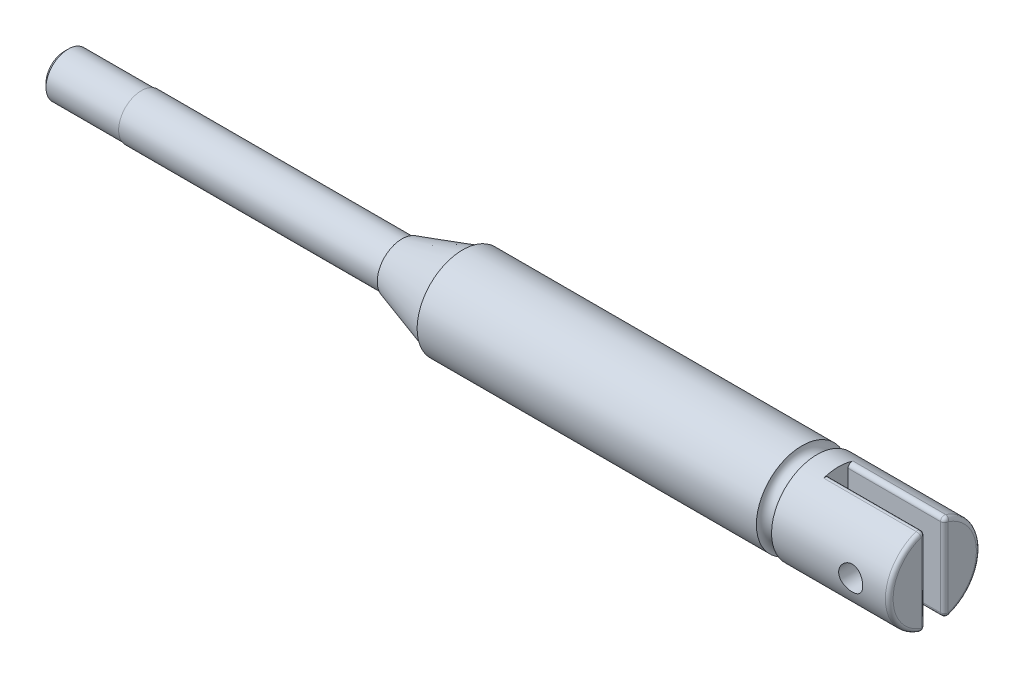
ISO-10303-21;
HEADER;
FILE_DESCRIPTION(('STEP AP214'),'2;1');
FILE_NAME('part.step','',(''),(''),'','','');
FILE_SCHEMA(('AUTOMOTIVE_DESIGN { 1 0 10303 214 1 1 1 1 }'));
ENDSEC;
DATA;
#1=APPLICATION_CONTEXT('core data for automotive mechanical design processes');
#2=APPLICATION_PROTOCOL_DEFINITION('international standard','automotive_design',2000,#1);
#3=PRODUCT_CONTEXT('',#1,'mechanical');
#4=PRODUCT('Part','Part','',(#3));
#5=PRODUCT_RELATED_PRODUCT_CATEGORY('part','',(#4));
#6=PRODUCT_DEFINITION_FORMATION('','',#4);
#7=PRODUCT_DEFINITION_CONTEXT('part definition',#1,'design');
#8=PRODUCT_DEFINITION('design','',#6,#7);
#9=PRODUCT_DEFINITION_SHAPE('','',#8);
#10=(LENGTH_UNIT() NAMED_UNIT(*) SI_UNIT(.MILLI.,.METRE.));
#11=(NAMED_UNIT(*) PLANE_ANGLE_UNIT() SI_UNIT($,.RADIAN.));
#12=(NAMED_UNIT(*) SI_UNIT($,.STERADIAN.) SOLID_ANGLE_UNIT());
#13=UNCERTAINTY_MEASURE_WITH_UNIT(LENGTH_MEASURE(1.E-05),#10,'distance_accuracy_value','');
#14=(GEOMETRIC_REPRESENTATION_CONTEXT(3) GLOBAL_UNCERTAINTY_ASSIGNED_CONTEXT((#13)) GLOBAL_UNIT_ASSIGNED_CONTEXT((#10,
#11,#12)) REPRESENTATION_CONTEXT('',''));
#15=CARTESIAN_POINT('',(0.,0.,0.));
#16=DIRECTION('',(0.,0.,1.));
#17=DIRECTION('',(1.,0.,0.));
#18=AXIS2_PLACEMENT_3D('',#15,#16,#17);
#19=CARTESIAN_POINT('',(-76.0312923411787,0.,0.));
#20=DIRECTION('',(-1.,0.,0.));
#21=DIRECTION('',(0.,-1.,0.));
#22=AXIS2_PLACEMENT_3D('',#19,#20,#21);
#23=CYLINDRICAL_SURFACE('',#22,1.49999999999999);
#24=CARTESIAN_POINT('',(-52.28844,0.,0.));
#25=DIRECTION('',(-1.,0.,0.));
#26=DIRECTION('',(0.,-1.,0.));
#27=AXIS2_PLACEMENT_3D('',#24,#25,#26);
#28=CIRCLE('',#27,1.50000000000001);
#29=CARTESIAN_POINT('',(-52.28844,-1.50000000000001,0.));
#30=VERTEX_POINT('',#29);
#31=EDGE_CURVE('E333',#30,#30,#28,.T.);
#32=ORIENTED_EDGE('',*,*,#31,.F.);
#33=EDGE_LOOP('',(#32));
#34=FACE_BOUND('',#33,.T.);
#35=CARTESIAN_POINT('',(-35.114992,0.,0.));
#36=DIRECTION('',(-1.,0.,0.));
#37=DIRECTION('',(0.,-1.,0.));
#38=AXIS2_PLACEMENT_3D('',#35,#36,#37);
#39=CIRCLE('',#38,1.49999999999999);
#40=CARTESIAN_POINT('',(-35.114992,-1.49999999999998,0.));
#41=VERTEX_POINT('',#40);
#42=EDGE_CURVE('E326',#41,#41,#39,.T.);
#43=ORIENTED_EDGE('',*,*,#42,.T.);
#44=EDGE_LOOP('',(#43));
#45=FACE_BOUND('',#44,.T.);
#46=ADVANCED_FACE('F39',(#34,#45),#23,.T.);
#47=CARTESIAN_POINT('',(-35.114992,1.627,0.));
#48=DIRECTION('',(1.,0.,0.));
#49=DIRECTION('',(0.,1.,0.));
#50=AXIS2_PLACEMENT_3D('',#47,#48,#49);
#51=PLANE('',#50);
#52=ORIENTED_EDGE('',*,*,#42,.F.);
#53=EDGE_LOOP('',(#52));
#54=FACE_BOUND('',#53,.T.);
#55=CARTESIAN_POINT('',(-35.114992,0.,0.));
#56=DIRECTION('',(-1.,0.,0.));
#57=DIRECTION('',(0.,-1.,0.));
#58=AXIS2_PLACEMENT_3D('',#55,#56,#57);
#59=CIRCLE('',#58,1.62699999999999);
#60=CARTESIAN_POINT('',(-35.114992,-1.62699999999998,0.));
#61=VERTEX_POINT('',#60);
#62=EDGE_CURVE('E493',#61,#61,#59,.T.);
#63=ORIENTED_EDGE('',*,*,#62,.T.);
#64=EDGE_LOOP('',(#63));
#65=FACE_BOUND('',#64,.T.);
#66=ADVANCED_FACE('F239',(#54,#65),#51,.F.);
#67=CARTESIAN_POINT('',(-31.115,0.,0.));
#68=DIRECTION('',(1.,0.,0.));
#69=DIRECTION('',(0.,1.,0.));
#70=AXIS2_PLACEMENT_3D('',#67,#68,#69);
#71=CONICAL_SURFACE('',#70,2.87299999999999,0.301974145053179);
#72=ORIENTED_EDGE('',*,*,#62,.F.);
#73=EDGE_LOOP('',(#72));
#74=FACE_BOUND('',#73,.T.);
#75=CARTESIAN_POINT('',(-31.115,0.,0.));
#76=DIRECTION('',(-1.,0.,0.));
#77=DIRECTION('',(0.,-1.,0.));
#78=AXIS2_PLACEMENT_3D('',#75,#76,#77);
#79=CIRCLE('',#78,2.87299999999999);
#80=CARTESIAN_POINT('',(-31.115,-2.87299999999998,0.));
#81=VERTEX_POINT('',#80);
#82=EDGE_CURVE('E490',#81,#81,#79,.T.);
#83=ORIENTED_EDGE('',*,*,#82,.T.);
#84=EDGE_LOOP('',(#83));
#85=FACE_BOUND('',#84,.T.);
#86=ADVANCED_FACE('F247',(#74,#85),#71,.T.);
#87=CARTESIAN_POINT('',(-31.115,3.,0.));
#88=DIRECTION('',(1.,0.,0.));
#89=DIRECTION('',(0.,1.,0.));
#90=AXIS2_PLACEMENT_3D('',#87,#88,#89);
#91=PLANE('',#90);
#92=ORIENTED_EDGE('',*,*,#82,.F.);
#93=EDGE_LOOP('',(#92));
#94=FACE_BOUND('',#93,.T.);
#95=CARTESIAN_POINT('',(-31.115,0.,0.));
#96=DIRECTION('',(-1.,0.,0.));
#97=DIRECTION('',(0.,-1.,0.));
#98=AXIS2_PLACEMENT_3D('',#95,#96,#97);
#99=CIRCLE('',#98,2.99999999999999);
#100=CARTESIAN_POINT('',(-31.115,-2.99999999999998,0.));
#101=VERTEX_POINT('',#100);
#102=EDGE_CURVE('E314',#101,#101,#99,.T.);
#103=ORIENTED_EDGE('',*,*,#102,.T.);
#104=EDGE_LOOP('',(#103));
#105=FACE_BOUND('',#104,.T.);
#106=ADVANCED_FACE('F482',(#94,#105),#91,.F.);
#107=CARTESIAN_POINT('',(-76.0312923411787,0.,0.));
#108=DIRECTION('',(-1.,0.,0.));
#109=DIRECTION('',(0.,-1.,0.));
#110=AXIS2_PLACEMENT_3D('',#107,#108,#109);
#111=CYLINDRICAL_SURFACE('',#110,2.99999999999999);
#112=CARTESIAN_POINT('',(-8.755,0.,0.));
#113=DIRECTION('',(1.,0.,0.));
#114=DIRECTION('',(0.,1.,0.));
#115=AXIS2_PLACEMENT_3D('',#112,#113,#114);
#116=CIRCLE('',#115,2.99999999999999);
#117=CARTESIAN_POINT('',(-8.755,3.,0.));
#118=VERTEX_POINT('',#117);
#119=EDGE_CURVE('E211',#118,#118,#116,.F.);
#120=ORIENTED_EDGE('',*,*,#119,.T.);
#121=EDGE_LOOP('',(#120));
#122=FACE_BOUND('',#121,.T.);
#123=ORIENTED_EDGE('',*,*,#102,.F.);
#124=EDGE_LOOP('',(#123));
#125=FACE_BOUND('',#124,.T.);
#126=ADVANCED_FACE('F342',(#122,#125),#111,.T.);
#127=CARTESIAN_POINT('',(-63.4330682425012,0.,0.));
#128=DIRECTION('',(-1.,0.,0.));
#129=DIRECTION('',(0.,-1.,0.));
#130=AXIS2_PLACEMENT_3D('',#127,#128,#129);
#131=CYLINDRICAL_SURFACE('',#130,1.4605);
#132=CARTESIAN_POINT('',(-57.11444,0.,0.));
#133=DIRECTION('',(1.,0.,0.));
#134=DIRECTION('',(0.,1.,0.));
#135=AXIS2_PLACEMENT_3D('',#132,#133,#134);
#136=CIRCLE('',#135,1.4605);
#137=CARTESIAN_POINT('',(-57.11444,1.4605,0.));
#138=VERTEX_POINT('',#137);
#139=EDGE_CURVE('E150',#138,#138,#136,.T.);
#140=ORIENTED_EDGE('',*,*,#139,.T.);
#141=EDGE_LOOP('',(#140));
#142=FACE_BOUND('',#141,.T.);
#143=CARTESIAN_POINT('',(-52.28844,0.,0.));
#144=DIRECTION('',(-1.,0.,0.));
#145=DIRECTION('',(0.,-1.,0.));
#146=AXIS2_PLACEMENT_3D('',#143,#144,#145);
#147=CIRCLE('',#146,1.4605);
#148=CARTESIAN_POINT('',(-52.28844,-1.4605,0.));
#149=VERTEX_POINT('',#148);
#150=EDGE_CURVE('E198',#149,#149,#147,.T.);
#151=ORIENTED_EDGE('',*,*,#150,.T.);
#152=EDGE_LOOP('',(#151));
#153=FACE_BOUND('',#152,.T.);
#154=ADVANCED_FACE('F337',(#142,#153),#131,.T.);
#155=CARTESIAN_POINT('',(-52.28844,1.50000000000001,0.));
#156=DIRECTION('',(1.,0.,0.));
#157=DIRECTION('',(0.,1.,0.));
#158=AXIS2_PLACEMENT_3D('',#155,#156,#157);
#159=PLANE('',#158);
#160=ORIENTED_EDGE('',*,*,#150,.F.);
#161=EDGE_LOOP('',(#160));
#162=FACE_BOUND('',#161,.T.);
#163=ORIENTED_EDGE('',*,*,#31,.T.);
#164=EDGE_LOOP('',(#163));
#165=FACE_BOUND('',#164,.T.);
#166=ADVANCED_FACE('F255',(#162,#165),#159,.F.);
#167=CARTESIAN_POINT('',(-57.36844,0.,0.));
#168=DIRECTION('',(1.,0.,0.));
#169=DIRECTION('',(0.,1.,0.));
#170=AXIS2_PLACEMENT_3D('',#167,#168,#169);
#171=PLANE('',#170);
#172=CARTESIAN_POINT('',(-57.36844,0.,0.));
#173=DIRECTION('',(1.,0.,0.));
#174=DIRECTION('',(0.,1.,0.));
#175=AXIS2_PLACEMENT_3D('',#172,#173,#174);
#176=CIRCLE('',#175,1.20649999999999);
#177=CARTESIAN_POINT('',(-57.36844,1.20649999999999,0.));
#178=VERTEX_POINT('',#177);
#179=EDGE_CURVE('E321',#178,#178,#176,.F.);
#180=ORIENTED_EDGE('',*,*,#179,.T.);
#181=EDGE_LOOP('',(#180));
#182=FACE_BOUND('',#181,.T.);
#183=ADVANCED_FACE('F234',(#182),#171,.F.);
#184=CARTESIAN_POINT('',(-57.36844,0.,0.));
#185=DIRECTION('',(1.,0.,0.));
#186=DIRECTION('',(0.,1.,0.));
#187=AXIS2_PLACEMENT_3D('',#184,#185,#186);
#188=CONICAL_SURFACE('',#187,1.20649999999999,0.785398163397466);
#189=ORIENTED_EDGE('',*,*,#139,.F.);
#190=EDGE_LOOP('',(#189));
#191=FACE_BOUND('',#190,.T.);
#192=ORIENTED_EDGE('',*,*,#179,.F.);
#193=EDGE_LOOP('',(#192));
#194=FACE_BOUND('',#193,.T.);
#195=ADVANCED_FACE('F224',(#191,#194),#188,.T.);
#196=CARTESIAN_POINT('',(-8.255,0.,0.));
#197=DIRECTION('',(1.,0.,0.));
#198=DIRECTION('',(0.,1.,0.));
#199=AXIS2_PLACEMENT_3D('',#196,#197,#198);
#200=TOROIDAL_SURFACE('',#199,2.99999999999999,0.500000000000001);
#201=ORIENTED_EDGE('',*,*,#119,.F.);
#202=EDGE_LOOP('',(#201));
#203=FACE_BOUND('',#202,.T.);
#204=CARTESIAN_POINT('',(-7.755,0.,0.));
#205=DIRECTION('',(-1.,0.,0.));
#206=DIRECTION('',(0.,-1.,0.));
#207=AXIS2_PLACEMENT_3D('',#204,#205,#206);
#208=CIRCLE('',#207,2.99999999999999);
#209=CARTESIAN_POINT('',(-7.755,-2.99999999999997,0.));
#210=VERTEX_POINT('',#209);
#211=EDGE_CURVE('E43',#210,#210,#208,.F.);
#212=ORIENTED_EDGE('',*,*,#211,.F.);
#213=EDGE_LOOP('',(#212));
#214=FACE_BOUND('',#213,.T.);
#215=ADVANCED_FACE('F221',(#203,#214),#200,.F.);
#216=CARTESIAN_POINT('',(-0.254,0.,0.889));
#217=DIRECTION('',(0.,1.,0.));
#218=DIRECTION('',(-1.,0.,0.));
#219=AXIS2_PLACEMENT_3D('',#216,#217,#218);
#220=CYLINDRICAL_SURFACE('',#219,0.254);
#221=CARTESIAN_POINT('',(-0.253999999999999,-2.59811373884976,0.889));
#222=DIRECTION('',(0.,-1.,0.));
#223=DIRECTION('',(1.,0.,0.));
#224=AXIS2_PLACEMENT_3D('',#221,#222,#223);
#225=CIRCLE('',#224,0.254);
#226=CARTESIAN_POINT('',(0.,-2.59811373884976,0.889));
#227=VERTEX_POINT('',#226);
#228=CARTESIAN_POINT('',(-0.253999999999999,-2.59811373884976,0.635));
#229=VERTEX_POINT('',#228);
#230=EDGE_CURVE('E56',#227,#229,#225,.F.);
#231=ORIENTED_EDGE('',*,*,#230,.T.);
#232=DIRECTION('',(0.,1.,0.));
#233=VECTOR('',#232,1.);
#234=CARTESIAN_POINT('',(-0.253999999999999,-2.99999999999998,0.635));
#235=LINE('',#234,#233);
#236=CARTESIAN_POINT('',(-0.254,2.59811373884978,0.635));
#237=VERTEX_POINT('',#236);
#238=EDGE_CURVE('E181',#237,#229,#235,.F.);
#239=ORIENTED_EDGE('',*,*,#238,.F.);
#240=CARTESIAN_POINT('',(-0.254,2.59811373884978,0.889));
#241=DIRECTION('',(0.,1.,0.));
#242=DIRECTION('',(0.,0.,1.));
#243=AXIS2_PLACEMENT_3D('',#240,#241,#242);
#244=CIRCLE('',#243,0.254);
#245=CARTESIAN_POINT('',(0.,2.59811373884978,0.889));
#246=VERTEX_POINT('',#245);
#247=EDGE_CURVE('E199',#237,#246,#244,.F.);
#248=ORIENTED_EDGE('',*,*,#247,.T.);
#249=DIRECTION('',(0.,1.,0.));
#250=VECTOR('',#249,1.);
#251=CARTESIAN_POINT('',(0.,0.,0.889));
#252=LINE('',#251,#250);
#253=EDGE_CURVE('E177',#227,#246,#252,.T.);
#254=ORIENTED_EDGE('',*,*,#253,.F.);
#255=EDGE_LOOP('',(#231,#239,#248,#254));
#256=FACE_BOUND('',#255,.T.);
#257=ADVANCED_FACE('F223',(#256),#220,.T.);
#258=CARTESIAN_POINT('',(-0.254,0.,-0.889));
#259=DIRECTION('',(0.,-1.,0.));
#260=DIRECTION('',(1.,0.,0.));
#261=AXIS2_PLACEMENT_3D('',#258,#259,#260);
#262=CYLINDRICAL_SURFACE('',#261,0.254);
#263=CARTESIAN_POINT('',(-0.254,2.59811373884978,-0.889));
#264=DIRECTION('',(0.,1.,0.));
#265=DIRECTION('',(-1.,0.,0.));
#266=AXIS2_PLACEMENT_3D('',#263,#264,#265);
#267=CIRCLE('',#266,0.254);
#268=CARTESIAN_POINT('',(0.,2.59811373884978,-0.889));
#269=VERTEX_POINT('',#268);
#270=CARTESIAN_POINT('',(-0.254,2.59811373884978,-0.635));
#271=VERTEX_POINT('',#270);
#272=EDGE_CURVE('E131',#269,#271,#267,.F.);
#273=ORIENTED_EDGE('',*,*,#272,.T.);
#274=DIRECTION('',(0.,-1.,0.));
#275=VECTOR('',#274,1.);
#276=CARTESIAN_POINT('',(-0.253999999999999,-2.99999999999998,-0.635));
#277=LINE('',#276,#275);
#278=CARTESIAN_POINT('',(-0.253999999999999,-2.59811373884976,-0.635));
#279=VERTEX_POINT('',#278);
#280=EDGE_CURVE('E128',#279,#271,#277,.F.);
#281=ORIENTED_EDGE('',*,*,#280,.F.);
#282=CARTESIAN_POINT('',(-0.253999999999999,-2.59811373884976,-0.889));
#283=DIRECTION('',(0.,-1.,0.));
#284=DIRECTION('',(0.,0.,-1.));
#285=AXIS2_PLACEMENT_3D('',#282,#283,#284);
#286=CIRCLE('',#285,0.254);
#287=CARTESIAN_POINT('',(0.,-2.59811373884976,-0.889));
#288=VERTEX_POINT('',#287);
#289=EDGE_CURVE('E122',#279,#288,#286,.F.);
#290=ORIENTED_EDGE('',*,*,#289,.T.);
#291=DIRECTION('',(0.,-1.,0.));
#292=VECTOR('',#291,1.);
#293=CARTESIAN_POINT('',(0.,0.,-0.889));
#294=LINE('',#293,#292);
#295=EDGE_CURVE('E126',#269,#288,#294,.T.);
#296=ORIENTED_EDGE('',*,*,#295,.F.);
#297=EDGE_LOOP('',(#273,#281,#290,#296));
#298=FACE_BOUND('',#297,.T.);
#299=ADVANCED_FACE('F124',(#298),#262,.T.);
#300=CARTESIAN_POINT('',(0.,0.,0.));
#301=DIRECTION('',(-1.,0.,0.));
#302=DIRECTION('',(0.,-1.,0.));
#303=AXIS2_PLACEMENT_3D('',#300,#301,#302);
#304=PLANE('',#303);
#305=CARTESIAN_POINT('',(0.,0.,0.));
#306=DIRECTION('',(-1.,0.,0.));
#307=DIRECTION('',(0.,-1.,0.));
#308=AXIS2_PLACEMENT_3D('',#305,#306,#307);
#309=CIRCLE('',#308,2.74599999999999);
#310=EDGE_CURVE('E145',#288,#269,#309,.F.);
#311=ORIENTED_EDGE('',*,*,#310,.T.);
#312=ORIENTED_EDGE('',*,*,#295,.T.);
#313=EDGE_LOOP('',(#311,#312));
#314=FACE_BOUND('',#313,.T.);
#315=ADVANCED_FACE('F152',(#314),#304,.F.);
#316=CARTESIAN_POINT('',(-0.254,2.59811373884978,-0.889));
#317=DIRECTION('',(0.,0.,1.));
#318=DIRECTION('',(1.,0.,0.));
#319=AXIS2_PLACEMENT_3D('',#316,#317,#318);
#320=SPHERICAL_SURFACE('',#319,0.254);
#321=CARTESIAN_POINT('',(-0.254,2.59811373884978,-0.889));
#322=DIRECTION('',(0.,0.323743627093956,0.946144842989724));
#323=DIRECTION('',(0.,-0.946144842989724,0.323743627093956));
#324=AXIS2_PLACEMENT_3D('',#321,#322,#323);
#325=CIRCLE('',#324,0.254);
#326=CARTESIAN_POINT('',(-0.254000000000005,2.83843452896917,-0.971230881281865));
#327=VERTEX_POINT('',#326);
#328=EDGE_CURVE('E142',#269,#327,#325,.T.);
#329=ORIENTED_EDGE('',*,*,#328,.T.);
#330=CARTESIAN_POINT('',(-0.254000000000005,2.59811373884978,-0.889));
#331=DIRECTION('',(1.,0.,0.));
#332=DIRECTION('',(0.,0.,-1.));
#333=AXIS2_PLACEMENT_3D('',#330,#331,#332);
#334=CIRCLE('',#333,0.254);
#335=EDGE_CURVE('E195',#327,#271,#334,.T.);
#336=ORIENTED_EDGE('',*,*,#335,.T.);
#337=ORIENTED_EDGE('',*,*,#272,.F.);
#338=EDGE_LOOP('',(#329,#336,#337));
#339=FACE_BOUND('',#338,.T.);
#340=ADVANCED_FACE('F264',(#339),#320,.T.);
#341=CARTESIAN_POINT('',(0.,0.,0.));
#342=DIRECTION('',(-1.,0.,0.));
#343=DIRECTION('',(0.,-1.,0.));
#344=AXIS2_PLACEMENT_3D('',#341,#342,#343);
#345=CIRCLE('',#344,2.74599999999999);
#346=EDGE_CURVE('E175',#246,#227,#345,.F.);
#347=ORIENTED_EDGE('',*,*,#346,.T.);
#348=ORIENTED_EDGE('',*,*,#253,.T.);
#349=EDGE_LOOP('',(#347,#348));
#350=FACE_BOUND('',#349,.T.);
#351=ADVANCED_FACE('F267',(#350),#304,.F.);
#352=CARTESIAN_POINT('',(-0.254,2.59811373884978,0.889));
#353=DIRECTION('',(0.,0.,1.));
#354=DIRECTION('',(1.,0.,0.));
#355=AXIS2_PLACEMENT_3D('',#352,#353,#354);
#356=SPHERICAL_SURFACE('',#355,0.254);
#357=CARTESIAN_POINT('',(-0.254,2.59811373884978,0.889));
#358=DIRECTION('',(1.,0.,0.));
#359=DIRECTION('',(0.,1.,0.));
#360=AXIS2_PLACEMENT_3D('',#357,#358,#359);
#361=CIRCLE('',#360,0.254);
#362=CARTESIAN_POINT('',(-0.254000000000005,2.83843452896917,0.971230881281865));
#363=VERTEX_POINT('',#362);
#364=EDGE_CURVE('E202',#237,#363,#361,.T.);
#365=ORIENTED_EDGE('',*,*,#364,.T.);
#366=CARTESIAN_POINT('',(-0.254000000000005,2.59811373884978,0.889));
#367=DIRECTION('',(0.,0.323743627093956,-0.946144842989724));
#368=DIRECTION('',(0.,0.946144842989724,0.323743627093956));
#369=AXIS2_PLACEMENT_3D('',#366,#367,#368);
#370=CIRCLE('',#369,0.254);
#371=EDGE_CURVE('E205',#363,#246,#370,.T.);
#372=ORIENTED_EDGE('',*,*,#371,.T.);
#373=ORIENTED_EDGE('',*,*,#247,.F.);
#374=EDGE_LOOP('',(#365,#372,#373));
#375=FACE_BOUND('',#374,.T.);
#376=ADVANCED_FACE('F282',(#375),#356,.T.);
#377=CARTESIAN_POINT('',(-0.253999999999999,-2.59811373884976,0.889));
#378=DIRECTION('',(0.,0.,1.));
#379=DIRECTION('',(1.,0.,0.));
#380=AXIS2_PLACEMENT_3D('',#377,#378,#379);
#381=SPHERICAL_SURFACE('',#380,0.254);
#382=CARTESIAN_POINT('',(-0.253999999999999,-2.59811373884976,0.889));
#383=DIRECTION('',(0.,-0.323743627093956,-0.946144842989724));
#384=DIRECTION('',(0.,0.946144842989724,-0.323743627093956));
#385=AXIS2_PLACEMENT_3D('',#382,#383,#384);
#386=CIRCLE('',#385,0.254);
#387=CARTESIAN_POINT('',(-0.254000000000004,-2.83843452896915,0.971230881281865));
#388=VERTEX_POINT('',#387);
#389=EDGE_CURVE('E208',#227,#388,#386,.T.);
#390=ORIENTED_EDGE('',*,*,#389,.T.);
#391=CARTESIAN_POINT('',(-0.254000000000004,-2.59811373884976,0.889));
#392=DIRECTION('',(1.,0.,0.));
#393=DIRECTION('',(0.,0.,-1.));
#394=AXIS2_PLACEMENT_3D('',#391,#392,#393);
#395=CIRCLE('',#394,0.254);
#396=EDGE_CURVE('E132',#388,#229,#395,.T.);
#397=ORIENTED_EDGE('',*,*,#396,.T.);
#398=ORIENTED_EDGE('',*,*,#230,.F.);
#399=EDGE_LOOP('',(#390,#397,#398));
#400=FACE_BOUND('',#399,.T.);
#401=ADVANCED_FACE('F285',(#400),#381,.T.);
#402=CARTESIAN_POINT('',(-6.35,-2.99999999999998,0.635));
#403=DIRECTION('',(0.,0.,1.));
#404=DIRECTION('',(1.,0.,0.));
#405=AXIS2_PLACEMENT_3D('',#402,#403,#404);
#406=PLANE('',#405);
#407=CARTESIAN_POINT('',(-2.54,0.,0.635));
#408=DIRECTION('',(0.,0.,1.));
#409=DIRECTION('',(1.,0.,0.));
#410=AXIS2_PLACEMENT_3D('',#407,#408,#409);
#411=CIRCLE('',#410,0.79375);
#412=CARTESIAN_POINT('',(-1.74625,0.,0.635));
#413=VERTEX_POINT('',#412);
#414=EDGE_CURVE('E332',#413,#413,#411,.T.);
#415=ORIENTED_EDGE('',*,*,#414,.T.);
#416=EDGE_LOOP('',(#415));
#417=FACE_BOUND('',#416,.T.);
#418=ORIENTED_EDGE('',*,*,#238,.T.);
#419=DIRECTION('',(-1.,0.,0.));
#420=VECTOR('',#419,1.);
#421=CARTESIAN_POINT('',(-6.35,-2.59811373884976,0.635));
#422=LINE('',#421,#420);
#423=CARTESIAN_POINT('',(-6.35,-2.59811373884976,0.635));
#424=VERTEX_POINT('',#423);
#425=EDGE_CURVE('E183',#229,#424,#422,.T.);
#426=ORIENTED_EDGE('',*,*,#425,.T.);
#427=DIRECTION('',(0.,1.,0.));
#428=VECTOR('',#427,1.);
#429=CARTESIAN_POINT('',(-6.35,-2.99999999999998,0.635));
#430=LINE('',#429,#428);
#431=CARTESIAN_POINT('',(-6.35,2.59811373884978,0.635));
#432=VERTEX_POINT('',#431);
#433=EDGE_CURVE('E310',#424,#432,#430,.T.);
#434=ORIENTED_EDGE('',*,*,#433,.T.);
#435=DIRECTION('',(-1.,0.,0.));
#436=VECTOR('',#435,1.);
#437=CARTESIAN_POINT('',(-6.35,2.59811373884978,0.635));
#438=LINE('',#437,#436);
#439=EDGE_CURVE('E64',#432,#237,#438,.F.);
#440=ORIENTED_EDGE('',*,*,#439,.T.);
#441=EDGE_LOOP('',(#418,#426,#434,#440));
#442=FACE_BOUND('',#441,.T.);
#443=ADVANCED_FACE('F289',(#417,#442),#406,.F.);
#444=CARTESIAN_POINT('',(-6.35,-2.99999999999998,-0.635));
#445=DIRECTION('',(0.,0.,-1.));
#446=DIRECTION('',(-1.,0.,0.));
#447=AXIS2_PLACEMENT_3D('',#444,#445,#446);
#448=PLANE('',#447);
#449=CARTESIAN_POINT('',(-2.54,0.,-0.635));
#450=DIRECTION('',(0.,0.,-1.));
#451=DIRECTION('',(-1.,0.,0.));
#452=AXIS2_PLACEMENT_3D('',#449,#450,#451);
#453=CIRCLE('',#452,0.79375);
#454=CARTESIAN_POINT('',(-3.33375,0.,-0.635));
#455=VERTEX_POINT('',#454);
#456=EDGE_CURVE('E330',#455,#455,#453,.T.);
#457=ORIENTED_EDGE('',*,*,#456,.T.);
#458=EDGE_LOOP('',(#457));
#459=FACE_BOUND('',#458,.T.);
#460=DIRECTION('',(0.,1.,0.));
#461=VECTOR('',#460,1.);
#462=CARTESIAN_POINT('',(-6.35,-2.99999999999998,-0.635));
#463=LINE('',#462,#461);
#464=CARTESIAN_POINT('',(-6.35,-2.59811373884976,-0.635));
#465=VERTEX_POINT('',#464);
#466=CARTESIAN_POINT('',(-6.35,2.59811373884978,-0.635));
#467=VERTEX_POINT('',#466);
#468=EDGE_CURVE('E315',#465,#467,#463,.T.);
#469=ORIENTED_EDGE('',*,*,#468,.F.);
#470=DIRECTION('',(-1.,0.,0.));
#471=VECTOR('',#470,1.);
#472=CARTESIAN_POINT('',(-6.35,-2.59811373884976,-0.635));
#473=LINE('',#472,#471);
#474=EDGE_CURVE('E159',#465,#279,#473,.F.);
#475=ORIENTED_EDGE('',*,*,#474,.T.);
#476=ORIENTED_EDGE('',*,*,#280,.T.);
#477=DIRECTION('',(-1.,0.,0.));
#478=VECTOR('',#477,1.);
#479=CARTESIAN_POINT('',(-6.35,2.59811373884978,-0.635));
#480=LINE('',#479,#478);
#481=EDGE_CURVE('E153',#271,#467,#480,.T.);
#482=ORIENTED_EDGE('',*,*,#481,.T.);
#483=EDGE_LOOP('',(#469,#475,#476,#482));
#484=FACE_BOUND('',#483,.T.);
#485=ADVANCED_FACE('F263',(#459,#484),#448,.F.);
#486=CARTESIAN_POINT('',(-0.253999999999999,-2.59811373884976,-0.889));
#487=DIRECTION('',(0.,0.,1.));
#488=DIRECTION('',(1.,0.,0.));
#489=AXIS2_PLACEMENT_3D('',#486,#487,#488);
#490=SPHERICAL_SURFACE('',#489,0.254);
#491=CARTESIAN_POINT('',(-0.253999999999999,-2.59811373884976,-0.889));
#492=DIRECTION('',(1.,0.,0.));
#493=DIRECTION('',(0.,1.,0.));
#494=AXIS2_PLACEMENT_3D('',#491,#492,#493);
#495=CIRCLE('',#494,0.254);
#496=CARTESIAN_POINT('',(-0.254000000000004,-2.83843452896915,-0.971230881281865));
#497=VERTEX_POINT('',#496);
#498=EDGE_CURVE('E139',#279,#497,#495,.T.);
#499=ORIENTED_EDGE('',*,*,#498,.T.);
#500=CARTESIAN_POINT('',(-0.254000000000004,-2.59811373884976,-0.889));
#501=DIRECTION('',(0.,-0.323743627093957,0.946144842989724));
#502=DIRECTION('',(0.,-0.946144842989724,-0.323743627093957));
#503=AXIS2_PLACEMENT_3D('',#500,#501,#502);
#504=CIRCLE('',#503,0.254);
#505=EDGE_CURVE('E135',#497,#288,#504,.T.);
#506=ORIENTED_EDGE('',*,*,#505,.T.);
#507=ORIENTED_EDGE('',*,*,#289,.F.);
#508=EDGE_LOOP('',(#499,#506,#507));
#509=FACE_BOUND('',#508,.T.);
#510=ADVANCED_FACE('F137',(#509),#490,.T.);
#511=CARTESIAN_POINT('',(-2.54,0.,-2.99999999999999));
#512=DIRECTION('',(0.,0.,1.));
#513=DIRECTION('',(1.,0.,0.));
#514=AXIS2_PLACEMENT_3D('',#511,#512,#513);
#515=CYLINDRICAL_SURFACE('',#514,0.79375);
#516=ORIENTED_EDGE('',*,*,#456,.F.);
#517=EDGE_LOOP('',(#516));
#518=FACE_BOUND('',#517,.T.);
#519=CARTESIAN_POINT('',(-1.74625,0.,-2.99999999999999));
#520=CARTESIAN_POINT('',(-1.74625106466458,0.0437698375668157,-2.9999993282264));
#521=CARTESIAN_POINT('',(-1.74988254999377,0.0875511439939445,-2.99903265897856));
#522=CARTESIAN_POINT('',(-1.76428734018329,0.17385336792853,-2.9952702766813));
#523=CARTESIAN_POINT('',(-1.7750641600128,0.216373654348215,-2.99247366344542));
#524=CARTESIAN_POINT('',(-1.80338534416475,0.298895558183938,-2.98536019494753));
#525=CARTESIAN_POINT('',(-1.82092105910498,0.338900318931544,-2.9810452832695));
#526=CARTESIAN_POINT('',(-1.86223040276898,0.415400954854202,-2.97135167835241));
#527=CARTESIAN_POINT('',(-1.88600442136328,0.45189661052852,-2.96597291863203));
#528=CARTESIAN_POINT('',(-1.93968923528594,0.521177198313556,-2.95459529167835));
#529=CARTESIAN_POINT('',(-1.96971606590674,0.553870498840004,-2.948585955456));
#530=CARTESIAN_POINT('',(-2.03480605532623,0.613821062476154,-2.93669198347927));
#531=CARTESIAN_POINT('',(-2.06986985088904,0.641077637242554,-2.93080736359941));
#532=CARTESIAN_POINT('',(-2.14476729320822,0.689825783926276,-2.91972221312683));
#533=CARTESIAN_POINT('',(-2.1846714436118,0.711212314583401,-2.91453490163149));
#534=CARTESIAN_POINT('',(-2.26766841339288,0.746936853108402,-2.90558545856868));
#535=CARTESIAN_POINT('',(-2.31076065333328,0.761276138213968,-2.90182306877781));
#536=CARTESIAN_POINT('',(-2.39789667894256,0.782181634058109,-2.89625748536585));
#537=CARTESIAN_POINT('',(-2.44189791653429,0.788913803347784,-2.89441253550613));
#538=CARTESIAN_POINT('',(-2.53044095911576,0.794931306686499,-2.89276593751789));
#539=CARTESIAN_POINT('',(-2.57498266329633,0.794218008787497,-2.89296391401602));
#540=CARTESIAN_POINT('',(-2.66204993546567,0.785496664193203,-2.89534340740742));
#541=CARTESIAN_POINT('',(-2.70459730494513,0.777689037954792,-2.89747042426131));
#542=CARTESIAN_POINT('',(-2.78775562385429,0.755321500880883,-2.90338112457289));
#543=CARTESIAN_POINT('',(-2.82836642039022,0.740761057876009,-2.90716493859651));
#544=CARTESIAN_POINT('',(-2.90702314199696,0.705136935568971,-2.91601108429069));
#545=CARTESIAN_POINT('',(-2.94503548852245,0.684002677548692,-2.92108717740622));
#546=CARTESIAN_POINT('',(-3.01704483448691,0.635880102873265,-2.93193848850909));
#547=CARTESIAN_POINT('',(-3.05104105267015,0.608890650096443,-2.93771384208226));
#548=CARTESIAN_POINT('',(-3.11519864441466,0.548797335418491,-2.94954012997449));
#549=CARTESIAN_POINT('',(-3.14520196174313,0.515525063857159,-2.95559396059681));
#550=CARTESIAN_POINT('',(-3.19923505967777,0.444347463545209,-2.96712878584985));
#551=CARTESIAN_POINT('',(-3.22326461205786,0.406441957865631,-2.97260975859004));
#552=CARTESIAN_POINT('',(-3.26473616217239,0.326831593122855,-2.98241416327767));
#553=CARTESIAN_POINT('',(-3.28214993361147,0.285111376395161,-2.98673261299293));
#554=CARTESIAN_POINT('',(-3.30967123600047,0.199195346207609,-2.99368936208497));
#555=CARTESIAN_POINT('',(-3.31978033782868,0.155000067217067,-2.99632802268796));
#556=CARTESIAN_POINT('',(-3.3321580429915,0.0667376523615833,-2.99957341029864));
#557=CARTESIAN_POINT('',(-3.33464158096443,0.0227026605941382,-3.00023582426948));
#558=CARTESIAN_POINT('',(-3.33229070813109,-0.065154514564261,-2.99961399386761));
#559=CARTESIAN_POINT('',(-3.32745704105676,-0.108976719129068,-2.99832994733612));
#560=CARTESIAN_POINT('',(-3.31078538041926,-0.194399831758913,-2.99399540566287));
#561=CARTESIAN_POINT('',(-3.29906693342828,-0.23602574225483,-2.99097507794908));
#562=CARTESIAN_POINT('',(-3.26909688819508,-0.316717136609313,-2.98351028151612));
#563=CARTESIAN_POINT('',(-3.25084458770102,-0.355782344712057,-2.97906565972068));
#564=CARTESIAN_POINT('',(-3.20792399340457,-0.431081141367528,-2.96911443505799));
#565=CARTESIAN_POINT('',(-3.18313832885425,-0.467245269078571,-2.9635889383961));
#566=CARTESIAN_POINT('',(-3.12800244880278,-0.534976580546292,-2.95211485449207));
#567=CARTESIAN_POINT('',(-3.09765115191606,-0.566542868814267,-2.94616618516646));
#568=CARTESIAN_POINT('',(-3.03124314635651,-0.625085613836346,-2.93431188392032));
#569=CARTESIAN_POINT('',(-2.9950515704678,-0.651910529668655,-2.92841201919743));
#570=CARTESIAN_POINT('',(-2.91855627980036,-0.699109160049003,-2.91750500029281));
#571=CARTESIAN_POINT('',(-2.8782527386848,-0.719483146894132,-2.9124978084348));
#572=CARTESIAN_POINT('',(-2.79488111093695,-0.753048198559642,-2.90400040127052));
#573=CARTESIAN_POINT('',(-2.75183079398742,-0.766281053140331,-2.9005013849586));
#574=CARTESIAN_POINT('',(-2.66400796337882,-0.785288661572236,-2.89541367903229));
#575=CARTESIAN_POINT('',(-2.61923588440283,-0.791065285289,-2.89382451047521));
#576=CARTESIAN_POINT('',(-2.53079068680283,-0.794890137295294,-2.89277599719909));
#577=CARTESIAN_POINT('',(-2.48712872977834,-0.793181751627871,-2.893249576234));
#578=CARTESIAN_POINT('',(-2.40073930763013,-0.782648683082195,-2.89611640360626));
#579=CARTESIAN_POINT('',(-2.35801181919211,-0.773824177954277,-2.89850960399424));
#580=CARTESIAN_POINT('',(-2.275005182699,-0.749449449904848,-2.90490641512379));
#581=CARTESIAN_POINT('',(-2.23471010853109,-0.733950041015906,-2.90889784323185));
#582=CARTESIAN_POINT('',(-2.15726201415366,-0.696705015333011,-2.91804184333839));
#583=CARTESIAN_POINT('',(-2.12010948089842,-0.674958432791405,-2.92319459483875));
#584=CARTESIAN_POINT('',(-2.04883749080431,-0.625095478483187,-2.93426733469649));
#585=CARTESIAN_POINT('',(-2.01483725139236,-0.596812658972944,-2.94020524062604));
#586=CARTESIAN_POINT('',(-1.95198634295489,-0.534997634358597,-2.9520783115328));
#587=CARTESIAN_POINT('',(-1.92313692379283,-0.501464158860704,-2.95801347549711));
#588=CARTESIAN_POINT('',(-1.87081279392072,-0.429251570229419,-2.96936104731978));
#589=CARTESIAN_POINT('',(-1.84746340971163,-0.390479337398087,-2.97475989094736));
#590=CARTESIAN_POINT('',(-1.80765096430805,-0.309418659439655,-2.98427885720708));
#591=CARTESIAN_POINT('',(-1.79118341749862,-0.267132526308945,-2.98839981231976));
#592=CARTESIAN_POINT('',(-1.76778827306697,-0.187493841983335,-2.99435591929854));
#593=CARTESIAN_POINT('',(-1.75973001069687,-0.150489373439837,-2.99645714060735));
#594=CARTESIAN_POINT('',(-1.74896066930791,-0.075659407131333,-2.99927940540138));
#595=CARTESIAN_POINT('',(-1.74624907971998,-0.0378339881100275,-3.00000058067095));
#596=CARTESIAN_POINT('',(-1.74625,0.,-2.99999999999999));
#597=B_SPLINE_CURVE_WITH_KNOTS('',3,(#519,#520,#521,#522,#523,#524,#525,#526,#527,#528,#529,
#530,#531,#532,#533,#534,#535,#536,#537,#538,#539,#540,#541,#542,#543,#544,#545,#546,#547,#548,
#549,#550,#551,#552,#553,#554,#555,#556,#557,#558,#559,#560,#561,#562,#563,#564,#565,#566,#567,
#568,#569,#570,#571,#572,#573,#574,#575,#576,#577,#578,#579,#580,#581,#582,#583,#584,#585,#586,
#587,#588,#589,#590,#591,#592,#593,#594,#595,#596),.UNSPECIFIED.,.T.,.F.,(4,2,2,2,2,2,2,2,2,2,2,
2,2,2,2,2,2,2,2,2,2,2,2,2,2,2,2,2,2,2,2,2,2,2,2,2,2,2,4),(0.,0.131170778552684,
0.262406131221829,0.393474096165234,0.524550254315586,0.658319122095874,0.792104915603677,
0.928148246343878,1.06416691158815,1.1971571314056,1.33012291564059,1.45944527739847,
1.58877783239871,1.71954988805291,1.85034734099455,1.98534182002352,2.12034145568787,
2.25591076768455,2.39145091664823,2.52313392623773,2.65480355226297,2.78425176587794,
2.91371389663283,3.04568237466845,3.1776765210025,3.31333069649479,3.44897914518969,
3.58382492836286,3.71863688848134,3.84909835252879,3.97955655793919,4.10903870904436,
4.23854088751621,4.37179895192902,4.50508930803182,4.64117339839338,4.77716864961561,
4.89056152297319,5.00394356759626),.UNSPECIFIED.);
#598=CARTESIAN_POINT('',(-1.74625,0.,-2.99999999999999));
#599=VERTEX_POINT('',#598);
#600=EDGE_CURVE('E361',#599,#599,#597,.T.);
#601=ORIENTED_EDGE('',*,*,#600,.F.);
#602=EDGE_LOOP('',(#601));
#603=FACE_BOUND('',#602,.T.);
#604=ADVANCED_FACE('F262',(#518,#603),#515,.F.);
#605=ORIENTED_EDGE('',*,*,#414,.F.);
#606=EDGE_LOOP('',(#605));
#607=FACE_BOUND('',#606,.T.);
#608=CARTESIAN_POINT('',(-1.74625,0.,2.99999999999999));
#609=CARTESIAN_POINT('',(-1.74625106466458,-0.0437698375668021,2.9999993282264));
#610=CARTESIAN_POINT('',(-1.74988254999377,-0.087551143993931,2.99903265897856));
#611=CARTESIAN_POINT('',(-1.76428734018329,-0.173853367928517,2.9952702766813));
#612=CARTESIAN_POINT('',(-1.77506416001279,-0.216373654348202,2.99247366344542));
#613=CARTESIAN_POINT('',(-1.80338534416474,-0.298895558183926,2.98536019494753));
#614=CARTESIAN_POINT('',(-1.82092105910498,-0.338900318931531,2.98104528326949));
#615=CARTESIAN_POINT('',(-1.86223040276898,-0.415400954854191,2.97135167835241));
#616=CARTESIAN_POINT('',(-1.88600442136327,-0.451896610528509,2.96597291863203));
#617=CARTESIAN_POINT('',(-1.93968923528594,-0.521177198313546,2.95459529167835));
#618=CARTESIAN_POINT('',(-1.96971606590673,-0.553870498839994,2.94858595545599));
#619=CARTESIAN_POINT('',(-2.03480605532622,-0.613821062476145,2.93669198347927));
#620=CARTESIAN_POINT('',(-2.06986985088902,-0.641077637242546,2.93080736359941));
#621=CARTESIAN_POINT('',(-2.1447672932082,-0.689825783926269,2.91972221312683));
#622=CARTESIAN_POINT('',(-2.18467144361178,-0.711212314583395,2.91453490163148));
#623=CARTESIAN_POINT('',(-2.26766841339287,-0.746936853108397,2.90558545856868));
#624=CARTESIAN_POINT('',(-2.31076065333327,-0.761276138213964,2.90182306877781));
#625=CARTESIAN_POINT('',(-2.39789667894254,-0.782181634058106,2.89625748536584));
#626=CARTESIAN_POINT('',(-2.44189791653427,-0.788913803347782,2.89441253550612));
#627=CARTESIAN_POINT('',(-2.53044095911575,-0.794931306686499,2.89276593751788));
#628=CARTESIAN_POINT('',(-2.57498266329631,-0.794218008787498,2.89296391401601));
#629=CARTESIAN_POINT('',(-2.66204993546565,-0.785496664193205,2.89534340740741));
#630=CARTESIAN_POINT('',(-2.70459730494512,-0.777689037954794,2.8974704242613));
#631=CARTESIAN_POINT('',(-2.78775562385428,-0.755321500880887,2.90338112457288));
#632=CARTESIAN_POINT('',(-2.82836642039021,-0.740761057876014,2.90716493859651));
#633=CARTESIAN_POINT('',(-2.90702314199694,-0.705136935568977,2.91601108429068));
#634=CARTESIAN_POINT('',(-2.94503548852244,-0.684002677548699,2.92108717740621));
#635=CARTESIAN_POINT('',(-3.0170448344869,-0.635880102873274,2.93193848850908));
#636=CARTESIAN_POINT('',(-3.05104105267014,-0.608890650096453,2.93771384208226));
#637=CARTESIAN_POINT('',(-3.11519864441465,-0.548797335418502,2.94954012997448));
#638=CARTESIAN_POINT('',(-3.14520196174312,-0.51552506385717,2.9555939605968));
#639=CARTESIAN_POINT('',(-3.19923505967776,-0.444347463545221,2.96712878584984));
#640=CARTESIAN_POINT('',(-3.22326461205786,-0.406441957865644,2.97260975859004));
#641=CARTESIAN_POINT('',(-3.26473616217239,-0.326831593122869,2.98241416327766));
#642=CARTESIAN_POINT('',(-3.28214993361146,-0.285111376395175,2.98673261299293));
#643=CARTESIAN_POINT('',(-3.30967123600047,-0.199195346207623,2.99368936208497));
#644=CARTESIAN_POINT('',(-3.31978033782868,-0.155000067217081,2.99632802268796));
#645=CARTESIAN_POINT('',(-3.3321580429915,-0.0667376523615978,2.99957341029864));
#646=CARTESIAN_POINT('',(-3.33464158096443,-0.0227026605941526,3.00023582426948));
#647=CARTESIAN_POINT('',(-3.33229070813109,0.065154514564247,2.99961399386761));
#648=CARTESIAN_POINT('',(-3.32745704105676,0.108976719129054,2.99832994733612));
#649=CARTESIAN_POINT('',(-3.31078538041926,0.1943998317589,2.99399540566287));
#650=CARTESIAN_POINT('',(-3.29906693342828,0.236025742254817,2.99097507794908));
#651=CARTESIAN_POINT('',(-3.26909688819509,0.316717136609301,2.98351028151612));
#652=CARTESIAN_POINT('',(-3.25084458770103,0.355782344712046,2.97906565972068));
#653=CARTESIAN_POINT('',(-3.20792399340458,0.431081141367517,2.96911443505799));
#654=CARTESIAN_POINT('',(-3.18313832885425,0.467245269078561,2.96358893839611));
#655=CARTESIAN_POINT('',(-3.12800244880279,0.534976580546283,2.95211485449207));
#656=CARTESIAN_POINT('',(-3.09765115191607,0.566542868814258,2.94616618516646));
#657=CARTESIAN_POINT('',(-3.03124314635653,0.625085613836337,2.93431188392033));
#658=CARTESIAN_POINT('',(-2.99505157046782,0.651910529668647,2.92841201919743));
#659=CARTESIAN_POINT('',(-2.91855627980037,0.699109160048995,2.91750500029282));
#660=CARTESIAN_POINT('',(-2.87825273868481,0.719483146894126,2.91249780843481));
#661=CARTESIAN_POINT('',(-2.79488111093697,0.753048198559637,2.90400040127053));
#662=CARTESIAN_POINT('',(-2.75183079398744,0.766281053140328,2.90050138495861));
#663=CARTESIAN_POINT('',(-2.66400796337883,0.785288661572234,2.89541367903229));
#664=CARTESIAN_POINT('',(-2.61923588440284,0.791065285288999,2.89382451047522));
#665=CARTESIAN_POINT('',(-2.53079068680285,0.794890137295294,2.8927759971991));
#666=CARTESIAN_POINT('',(-2.48712872977836,0.793181751627872,2.89324957623401));
#667=CARTESIAN_POINT('',(-2.40073930763014,0.782648683082198,2.89611640360626));
#668=CARTESIAN_POINT('',(-2.35801181919212,0.77382417795428,2.89850960399425));
#669=CARTESIAN_POINT('',(-2.27500518269901,0.749449449904853,2.9049064151238));
#670=CARTESIAN_POINT('',(-2.23471010853111,0.733950041015911,2.90889784323186));
#671=CARTESIAN_POINT('',(-2.15726201415367,0.696705015333018,2.91804184333839));
#672=CARTESIAN_POINT('',(-2.12010948089843,0.674958432791412,2.92319459483876));
#673=CARTESIAN_POINT('',(-2.04883749080432,0.625095478483195,2.9342673346965));
#674=CARTESIAN_POINT('',(-2.01483725139237,0.596812658972953,2.94020524062605));
#675=CARTESIAN_POINT('',(-1.9519863429549,0.534997634358607,2.9520783115328));
#676=CARTESIAN_POINT('',(-1.92313692379283,0.501464158860714,2.95801347549712));
#677=CARTESIAN_POINT('',(-1.87081279392072,0.429251570229429,2.96936104731978));
#678=CARTESIAN_POINT('',(-1.84746340971164,0.390479337398098,2.97475989094737));
#679=CARTESIAN_POINT('',(-1.80765096430806,0.309418659439667,2.98427885720708));
#680=CARTESIAN_POINT('',(-1.79118341749863,0.267132526308957,2.98839981231976));
#681=CARTESIAN_POINT('',(-1.76778827306698,0.187493841983348,2.99435591929854));
#682=CARTESIAN_POINT('',(-1.75973001069687,0.15048937343985,2.99645714060735));
#683=CARTESIAN_POINT('',(-1.74896066930791,0.0756594071313466,2.99927940540138));
#684=CARTESIAN_POINT('',(-1.74624907971998,0.0378339881100412,3.00000058067095));
#685=CARTESIAN_POINT('',(-1.74625,0.,2.99999999999999));
#686=B_SPLINE_CURVE_WITH_KNOTS('',3,(#608,#609,#610,#611,#612,#613,#614,#615,#616,#617,#618,
#619,#620,#621,#622,#623,#624,#625,#626,#627,#628,#629,#630,#631,#632,#633,#634,#635,#636,#637,
#638,#639,#640,#641,#642,#643,#644,#645,#646,#647,#648,#649,#650,#651,#652,#653,#654,#655,#656,
#657,#658,#659,#660,#661,#662,#663,#664,#665,#666,#667,#668,#669,#670,#671,#672,#673,#674,#675,
#676,#677,#678,#679,#680,#681,#682,#683,#684,#685),.UNSPECIFIED.,.T.,.F.,(4,2,2,2,2,2,2,2,2,2,2,
2,2,2,2,2,2,2,2,2,2,2,2,2,2,2,2,2,2,2,2,2,2,2,2,2,2,2,4),(0.,0.131170778552684,
0.262406131221829,0.393474096165234,0.524550254315586,0.658319122095874,0.792104915603678,
0.928148246343878,1.06416691158815,1.1971571314056,1.3301229156406,1.45944527739847,
1.58877783239871,1.71954988805291,1.85034734099455,1.98534182002352,2.12034145568787,
2.25591076768455,2.39145091664823,2.52313392623773,2.65480355226297,2.78425176587794,
2.91371389663283,3.04568237466845,3.1776765210025,3.31333069649478,3.44897914518969,
3.58382492836286,3.71863688848134,3.84909835252879,3.9795565579392,4.10903870904436,
4.23854088751621,4.37179895192902,4.50508930803182,4.64117339839338,4.77716864961561,
4.89056152297319,5.00394356759626),.UNSPECIFIED.);
#687=CARTESIAN_POINT('',(-1.74625,0.,2.99999999999999));
#688=VERTEX_POINT('',#687);
#689=EDGE_CURVE('E353',#688,#688,#686,.T.);
#690=ORIENTED_EDGE('',*,*,#689,.F.);
#691=EDGE_LOOP('',(#690));
#692=FACE_BOUND('',#691,.T.);
#693=ADVANCED_FACE('F277',(#607,#692),#515,.F.);
#694=CARTESIAN_POINT('',(-0.254000000000004,0.,0.));
#695=DIRECTION('',(-1.,0.,0.));
#696=DIRECTION('',(0.,-1.,0.));
#697=AXIS2_PLACEMENT_3D('',#694,#695,#696);
#698=TOROIDAL_SURFACE('',#697,2.74599999999999,0.254);
#699=ORIENTED_EDGE('',*,*,#505,.F.);
#700=CARTESIAN_POINT('',(-0.254000000000004,0.,0.));
#701=DIRECTION('',(-1.,0.,0.));
#702=DIRECTION('',(0.,-1.,0.));
#703=AXIS2_PLACEMENT_3D('',#700,#701,#702);
#704=CIRCLE('',#703,2.99999999999999);
#705=EDGE_CURVE('E170',#327,#497,#704,.T.);
#706=ORIENTED_EDGE('',*,*,#705,.F.);
#707=ORIENTED_EDGE('',*,*,#328,.F.);
#708=ORIENTED_EDGE('',*,*,#310,.F.);
#709=EDGE_LOOP('',(#699,#706,#707,#708));
#710=FACE_BOUND('',#709,.T.);
#711=ADVANCED_FACE('F146',(#710),#698,.T.);
#712=CARTESIAN_POINT('',(-76.0312923411787,2.59811373884977,-0.889));
#713=DIRECTION('',(-1.,0.,0.));
#714=DIRECTION('',(0.,-1.,0.));
#715=AXIS2_PLACEMENT_3D('',#712,#713,#714);
#716=CYLINDRICAL_SURFACE('',#715,0.254);
#717=CARTESIAN_POINT('',(-6.34999999999999,2.59811373884978,-0.889));
#718=DIRECTION('',(-1.,0.,0.));
#719=DIRECTION('',(0.,0.,1.));
#720=AXIS2_PLACEMENT_3D('',#717,#718,#719);
#721=CIRCLE('',#720,0.254);
#722=CARTESIAN_POINT('',(-6.34999999999999,2.83843452896917,-0.971230881281865));
#723=VERTEX_POINT('',#722);
#724=EDGE_CURVE('E48',#467,#723,#721,.T.);
#725=ORIENTED_EDGE('',*,*,#724,.F.);
#726=ORIENTED_EDGE('',*,*,#481,.F.);
#727=ORIENTED_EDGE('',*,*,#335,.F.);
#728=DIRECTION('',(-1.,0.,0.));
#729=VECTOR('',#728,1.);
#730=CARTESIAN_POINT('',(-76.0312923411787,2.83843452896916,-0.971230881281865));
#731=LINE('',#730,#729);
#732=EDGE_CURVE('E168',#723,#327,#731,.F.);
#733=ORIENTED_EDGE('',*,*,#732,.F.);
#734=EDGE_LOOP('',(#725,#726,#727,#733));
#735=FACE_BOUND('',#734,.T.);
#736=ADVANCED_FACE('F276',(#735),#716,.T.);
#737=CARTESIAN_POINT('',(-76.0312923411787,2.59811373884977,0.889));
#738=DIRECTION('',(-1.,0.,0.));
#739=DIRECTION('',(0.,-1.,0.));
#740=AXIS2_PLACEMENT_3D('',#737,#738,#739);
#741=CYLINDRICAL_SURFACE('',#740,0.254);
#742=CARTESIAN_POINT('',(-6.34999999999999,2.59811373884978,0.889));
#743=DIRECTION('',(-1.,0.,0.));
#744=DIRECTION('',(0.,0.,1.));
#745=AXIS2_PLACEMENT_3D('',#742,#743,#744);
#746=CIRCLE('',#745,0.254);
#747=CARTESIAN_POINT('',(-6.34999999999999,2.83843452896917,0.971230881281865));
#748=VERTEX_POINT('',#747);
#749=EDGE_CURVE('E11',#748,#432,#746,.T.);
#750=ORIENTED_EDGE('',*,*,#749,.F.);
#751=DIRECTION('',(-1.,0.,0.));
#752=VECTOR('',#751,1.);
#753=CARTESIAN_POINT('',(-76.0312923411787,2.83843452896916,0.971230881281865));
#754=LINE('',#753,#752);
#755=EDGE_CURVE('E161',#363,#748,#754,.T.);
#756=ORIENTED_EDGE('',*,*,#755,.F.);
#757=ORIENTED_EDGE('',*,*,#364,.F.);
#758=ORIENTED_EDGE('',*,*,#439,.F.);
#759=EDGE_LOOP('',(#750,#756,#757,#758));
#760=FACE_BOUND('',#759,.T.);
#761=ADVANCED_FACE('F279',(#760),#741,.T.);
#762=CARTESIAN_POINT('',(-0.254000000000004,0.,0.));
#763=DIRECTION('',(-1.,0.,0.));
#764=DIRECTION('',(0.,-1.,0.));
#765=AXIS2_PLACEMENT_3D('',#762,#763,#764);
#766=TOROIDAL_SURFACE('',#765,2.74599999999999,0.254);
#767=ORIENTED_EDGE('',*,*,#371,.F.);
#768=CARTESIAN_POINT('',(-0.254000000000004,0.,0.));
#769=DIRECTION('',(-1.,0.,0.));
#770=DIRECTION('',(0.,-1.,0.));
#771=AXIS2_PLACEMENT_3D('',#768,#769,#770);
#772=CIRCLE('',#771,2.99999999999999);
#773=EDGE_CURVE('E164',#388,#363,#772,.T.);
#774=ORIENTED_EDGE('',*,*,#773,.F.);
#775=ORIENTED_EDGE('',*,*,#389,.F.);
#776=ORIENTED_EDGE('',*,*,#346,.F.);
#777=EDGE_LOOP('',(#767,#774,#775,#776));
#778=FACE_BOUND('',#777,.T.);
#779=ADVANCED_FACE('F292',(#778),#766,.T.);
#780=CARTESIAN_POINT('',(-76.0312923411787,-2.59811373884977,0.889));
#781=DIRECTION('',(-1.,0.,0.));
#782=DIRECTION('',(0.,-1.,0.));
#783=AXIS2_PLACEMENT_3D('',#780,#781,#782);
#784=CYLINDRICAL_SURFACE('',#783,0.254);
#785=CARTESIAN_POINT('',(-6.34999999999999,-2.59811373884976,0.889));
#786=DIRECTION('',(-1.,0.,0.));
#787=DIRECTION('',(0.,0.,1.));
#788=AXIS2_PLACEMENT_3D('',#785,#786,#787);
#789=CIRCLE('',#788,0.254);
#790=CARTESIAN_POINT('',(-6.34999999999999,-2.83843452896915,0.971230881281865));
#791=VERTEX_POINT('',#790);
#792=EDGE_CURVE('E187',#424,#791,#789,.T.);
#793=ORIENTED_EDGE('',*,*,#792,.F.);
#794=ORIENTED_EDGE('',*,*,#425,.F.);
#795=ORIENTED_EDGE('',*,*,#396,.F.);
#796=DIRECTION('',(-1.,0.,0.));
#797=VECTOR('',#796,1.);
#798=CARTESIAN_POINT('',(-76.0312923411787,-2.83843452896916,0.971230881281865));
#799=LINE('',#798,#797);
#800=EDGE_CURVE('E166',#791,#388,#799,.F.);
#801=ORIENTED_EDGE('',*,*,#800,.F.);
#802=EDGE_LOOP('',(#793,#794,#795,#801));
#803=FACE_BOUND('',#802,.T.);
#804=ADVANCED_FACE('F41',(#803),#784,.T.);
#805=CARTESIAN_POINT('',(-6.35,-2.99999999999998,0.635));
#806=DIRECTION('',(-1.,0.,0.));
#807=DIRECTION('',(0.,0.,1.));
#808=AXIS2_PLACEMENT_3D('',#805,#806,#807);
#809=PLANE('',#808);
#810=ORIENTED_EDGE('',*,*,#433,.F.);
#811=ORIENTED_EDGE('',*,*,#792,.T.);
#812=CARTESIAN_POINT('',(-6.34999999999999,0.,0.));
#813=DIRECTION('',(-1.,0.,0.));
#814=DIRECTION('',(0.,0.,1.));
#815=AXIS2_PLACEMENT_3D('',#812,#813,#814);
#816=CIRCLE('',#815,2.99999999999999);
#817=CARTESIAN_POINT('',(-6.34999999999999,-2.83843452896915,-0.971230881281865));
#818=VERTEX_POINT('',#817);
#819=EDGE_CURVE('E318',#818,#791,#816,.T.);
#820=ORIENTED_EDGE('',*,*,#819,.F.);
#821=CARTESIAN_POINT('',(-6.34999999999999,-2.59811373884976,-0.889));
#822=DIRECTION('',(-1.,0.,0.));
#823=DIRECTION('',(0.,0.,1.));
#824=AXIS2_PLACEMENT_3D('',#821,#822,#823);
#825=CIRCLE('',#824,0.254);
#826=EDGE_CURVE('E185',#818,#465,#825,.T.);
#827=ORIENTED_EDGE('',*,*,#826,.T.);
#828=ORIENTED_EDGE('',*,*,#468,.T.);
#829=ORIENTED_EDGE('',*,*,#724,.T.);
#830=EDGE_CURVE('E322',#748,#723,#816,.T.);
#831=ORIENTED_EDGE('',*,*,#830,.F.);
#832=ORIENTED_EDGE('',*,*,#749,.T.);
#833=EDGE_LOOP('',(#810,#811,#820,#827,#828,#829,#831,#832));
#834=FACE_BOUND('',#833,.T.);
#835=ADVANCED_FACE('F272',(#834),#809,.F.);
#836=CARTESIAN_POINT('',(-76.0312923411787,-2.59811373884977,-0.889));
#837=DIRECTION('',(-1.,0.,0.));
#838=DIRECTION('',(0.,-1.,0.));
#839=AXIS2_PLACEMENT_3D('',#836,#837,#838);
#840=CYLINDRICAL_SURFACE('',#839,0.254);
#841=ORIENTED_EDGE('',*,*,#826,.F.);
#842=DIRECTION('',(-1.,0.,0.));
#843=VECTOR('',#842,1.);
#844=CARTESIAN_POINT('',(-76.0312923411787,-2.83843452896916,-0.971230881281865));
#845=LINE('',#844,#843);
#846=EDGE_CURVE('E172',#497,#818,#845,.T.);
#847=ORIENTED_EDGE('',*,*,#846,.F.);
#848=ORIENTED_EDGE('',*,*,#498,.F.);
#849=ORIENTED_EDGE('',*,*,#474,.F.);
#850=EDGE_LOOP('',(#841,#847,#848,#849));
#851=FACE_BOUND('',#850,.T.);
#852=ADVANCED_FACE('F269',(#851),#840,.T.);
#853=ORIENTED_EDGE('',*,*,#211,.T.);
#854=EDGE_LOOP('',(#853));
#855=FACE_BOUND('',#854,.T.);
#856=ORIENTED_EDGE('',*,*,#846,.T.);
#857=ORIENTED_EDGE('',*,*,#819,.T.);
#858=ORIENTED_EDGE('',*,*,#800,.T.);
#859=ORIENTED_EDGE('',*,*,#773,.T.);
#860=ORIENTED_EDGE('',*,*,#755,.T.);
#861=ORIENTED_EDGE('',*,*,#830,.T.);
#862=ORIENTED_EDGE('',*,*,#732,.T.);
#863=ORIENTED_EDGE('',*,*,#705,.T.);
#864=EDGE_LOOP('',(#856,#857,#858,#859,#860,#861,#862,#863));
#865=FACE_BOUND('',#864,.T.);
#866=ORIENTED_EDGE('',*,*,#689,.T.);
#867=EDGE_LOOP('',(#866));
#868=FACE_BOUND('',#867,.T.);
#869=ORIENTED_EDGE('',*,*,#600,.T.);
#870=EDGE_LOOP('',(#869));
#871=FACE_BOUND('',#870,.T.);
#872=ADVANCED_FACE('F218',(#855,#865,#868,#871),#111,.T.);
#873=CLOSED_SHELL('',(#46,#66,#86,#106,#126,#154,#166,#183,#195,#215,#257,#299,#315,#340,#351,
#376,#401,#443,#485,#510,#604,#693,#711,#736,#761,#779,#804,#835,#852,#872));
#874=MANIFOLD_SOLID_BREP('B2',#873);
#875=ADVANCED_BREP_SHAPE_REPRESENTATION('',(#18,#874),#14);
#876=SHAPE_DEFINITION_REPRESENTATION(#9,#875);
ENDSEC;
END-ISO-10303-21;
